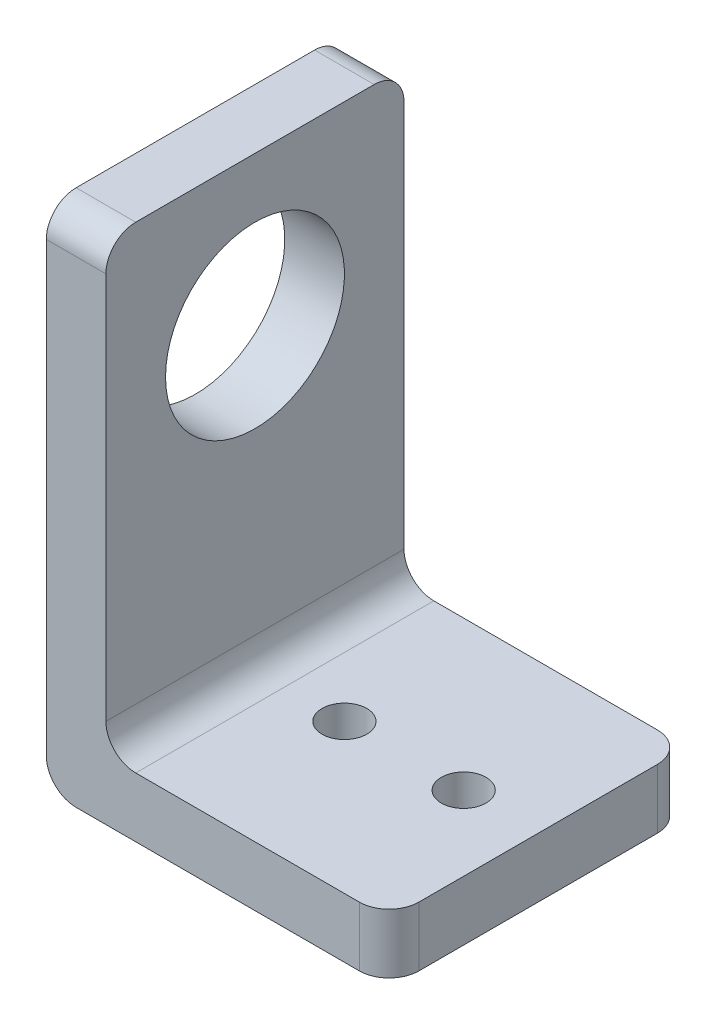
ISO-10303-21;
HEADER;
FILE_DESCRIPTION(('STEP AP214'),'2;1');
FILE_NAME('part.step','',(''),(''),'','','');
FILE_SCHEMA(('AUTOMOTIVE_DESIGN { 1 0 10303 214 1 1 1 1 }'));
ENDSEC;
DATA;
#1=APPLICATION_CONTEXT('core data for automotive mechanical design processes');
#2=APPLICATION_PROTOCOL_DEFINITION('international standard','automotive_design',2000,#1);
#3=PRODUCT_CONTEXT('',#1,'mechanical');
#4=PRODUCT('Part','Part','',(#3));
#5=PRODUCT_RELATED_PRODUCT_CATEGORY('part','',(#4));
#6=PRODUCT_DEFINITION_FORMATION('','',#4);
#7=PRODUCT_DEFINITION_CONTEXT('part definition',#1,'design');
#8=PRODUCT_DEFINITION('design','',#6,#7);
#9=PRODUCT_DEFINITION_SHAPE('','',#8);
#10=(LENGTH_UNIT() NAMED_UNIT(*) SI_UNIT(.MILLI.,.METRE.));
#11=(NAMED_UNIT(*) PLANE_ANGLE_UNIT() SI_UNIT($,.RADIAN.));
#12=(NAMED_UNIT(*) SI_UNIT($,.STERADIAN.) SOLID_ANGLE_UNIT());
#13=UNCERTAINTY_MEASURE_WITH_UNIT(LENGTH_MEASURE(1.E-05),#10,'distance_accuracy_value','');
#14=(GEOMETRIC_REPRESENTATION_CONTEXT(3) GLOBAL_UNCERTAINTY_ASSIGNED_CONTEXT((#13)) GLOBAL_UNIT_ASSIGNED_CONTEXT((#10,
#11,#12)) REPRESENTATION_CONTEXT('',''));
#15=CARTESIAN_POINT('',(0.,0.,0.));
#16=DIRECTION('',(0.,0.,1.));
#17=DIRECTION('',(1.,0.,0.));
#18=AXIS2_PLACEMENT_3D('',#15,#16,#17);
#19=CARTESIAN_POINT('',(0.,34.,20.));
#20=DIRECTION('',(1.,0.,0.));
#21=DIRECTION('',(0.,1.,0.));
#22=AXIS2_PLACEMENT_3D('',#19,#20,#21);
#23=PLANE('',#22);
#24=CARTESIAN_POINT('',(0.,24.,10.));
#25=DIRECTION('',(-1.,0.,0.));
#26=DIRECTION('',(0.,0.,1.));
#27=AXIS2_PLACEMENT_3D('',#24,#25,#26);
#28=CIRCLE('',#27,6.);
#29=CARTESIAN_POINT('',(0.,24.,16.));
#30=VERTEX_POINT('',#29);
#31=EDGE_CURVE('E249',#30,#30,#28,.T.);
#32=ORIENTED_EDGE('',*,*,#31,.F.);
#33=EDGE_LOOP('',(#32));
#34=FACE_BOUND('',#33,.T.);
#35=DIRECTION('',(0.,-1.,0.));
#36=VECTOR('',#35,1.);
#37=CARTESIAN_POINT('',(0.,34.,0.));
#38=LINE('',#37,#36);
#39=CARTESIAN_POINT('',(0.,32.,0.));
#40=VERTEX_POINT('',#39);
#41=CARTESIAN_POINT('',(0.,2.,0.));
#42=VERTEX_POINT('',#41);
#43=EDGE_CURVE('E222',#40,#42,#38,.T.);
#44=ORIENTED_EDGE('',*,*,#43,.T.);
#45=DIRECTION('',(0.,0.,-1.));
#46=VECTOR('',#45,1.);
#47=CARTESIAN_POINT('',(0.,2.,20.));
#48=LINE('',#47,#46);
#49=CARTESIAN_POINT('',(0.,2.,20.));
#50=VERTEX_POINT('',#49);
#51=EDGE_CURVE('E183',#42,#50,#48,.F.);
#52=ORIENTED_EDGE('',*,*,#51,.T.);
#53=DIRECTION('',(0.,-1.,0.));
#54=VECTOR('',#53,1.);
#55=CARTESIAN_POINT('',(0.,34.,20.));
#56=LINE('',#55,#54);
#57=CARTESIAN_POINT('',(0.,32.,20.));
#58=VERTEX_POINT('',#57);
#59=EDGE_CURVE('E228',#58,#50,#56,.T.);
#60=ORIENTED_EDGE('',*,*,#59,.F.);
#61=CARTESIAN_POINT('',(0.,32.,18.));
#62=DIRECTION('',(1.,0.,0.));
#63=DIRECTION('',(0.,1.,0.));
#64=AXIS2_PLACEMENT_3D('',#61,#62,#63);
#65=CIRCLE('',#64,2.);
#66=CARTESIAN_POINT('',(0.,34.,18.));
#67=VERTEX_POINT('',#66);
#68=EDGE_CURVE('E55',#58,#67,#65,.F.);
#69=ORIENTED_EDGE('',*,*,#68,.T.);
#70=DIRECTION('',(0.,0.,-1.));
#71=VECTOR('',#70,1.);
#72=CARTESIAN_POINT('',(0.,34.,20.));
#73=LINE('',#72,#71);
#74=CARTESIAN_POINT('',(0.,34.,2.));
#75=VERTEX_POINT('',#74);
#76=EDGE_CURVE('E215',#67,#75,#73,.T.);
#77=ORIENTED_EDGE('',*,*,#76,.T.);
#78=CARTESIAN_POINT('',(0.,32.,2.));
#79=DIRECTION('',(1.,0.,0.));
#80=DIRECTION('',(0.,1.,0.));
#81=AXIS2_PLACEMENT_3D('',#78,#79,#80);
#82=CIRCLE('',#81,2.);
#83=EDGE_CURVE('E47',#75,#40,#82,.F.);
#84=ORIENTED_EDGE('',*,*,#83,.T.);
#85=EDGE_LOOP('',(#44,#52,#60,#69,#77,#84));
#86=FACE_BOUND('',#85,.T.);
#87=ADVANCED_FACE('F32',(#34,#86),#23,.F.);
#88=CARTESIAN_POINT('',(0.,0.,20.));
#89=DIRECTION('',(0.,1.,0.));
#90=DIRECTION('',(0.,0.,1.));
#91=AXIS2_PLACEMENT_3D('',#88,#89,#90);
#92=PLANE('',#91);
#93=CARTESIAN_POINT('',(10.,0.,10.));
#94=DIRECTION('',(0.,1.,0.));
#95=DIRECTION('',(-1.,0.,0.));
#96=AXIS2_PLACEMENT_3D('',#93,#94,#95);
#97=CIRCLE('',#96,1.5);
#98=CARTESIAN_POINT('',(8.50000000000001,0.,10.));
#99=VERTEX_POINT('',#98);
#100=EDGE_CURVE('E258',#99,#99,#97,.T.);
#101=ORIENTED_EDGE('',*,*,#100,.T.);
#102=EDGE_LOOP('',(#101));
#103=FACE_BOUND('',#102,.T.);
#104=CARTESIAN_POINT('',(18.,0.,10.));
#105=DIRECTION('',(0.,1.,0.));
#106=DIRECTION('',(-1.,0.,0.));
#107=AXIS2_PLACEMENT_3D('',#104,#105,#106);
#108=CIRCLE('',#107,1.5);
#109=CARTESIAN_POINT('',(16.5,0.,10.));
#110=VERTEX_POINT('',#109);
#111=EDGE_CURVE('E252',#110,#110,#108,.T.);
#112=ORIENTED_EDGE('',*,*,#111,.T.);
#113=EDGE_LOOP('',(#112));
#114=FACE_BOUND('',#113,.T.);
#115=DIRECTION('',(1.,0.,0.));
#116=VECTOR('',#115,1.);
#117=CARTESIAN_POINT('',(0.,0.,0.));
#118=LINE('',#117,#116);
#119=CARTESIAN_POINT('',(2.,0.,0.));
#120=VERTEX_POINT('',#119);
#121=CARTESIAN_POINT('',(21.,0.,0.));
#122=VERTEX_POINT('',#121);
#123=EDGE_CURVE('E200',#120,#122,#118,.T.);
#124=ORIENTED_EDGE('',*,*,#123,.T.);
#125=CARTESIAN_POINT('',(21.,0.,2.));
#126=DIRECTION('',(0.,1.,0.));
#127=DIRECTION('',(0.,0.,1.));
#128=AXIS2_PLACEMENT_3D('',#125,#126,#127);
#129=CIRCLE('',#128,2.);
#130=CARTESIAN_POINT('',(23.,0.,2.));
#131=VERTEX_POINT('',#130);
#132=EDGE_CURVE('E165',#122,#131,#129,.F.);
#133=ORIENTED_EDGE('',*,*,#132,.T.);
#134=DIRECTION('',(0.,0.,-1.));
#135=VECTOR('',#134,1.);
#136=CARTESIAN_POINT('',(23.,0.,20.));
#137=LINE('',#136,#135);
#138=CARTESIAN_POINT('',(23.,0.,18.));
#139=VERTEX_POINT('',#138);
#140=EDGE_CURVE('E143',#139,#131,#137,.T.);
#141=ORIENTED_EDGE('',*,*,#140,.F.);
#142=CARTESIAN_POINT('',(21.,0.,18.));
#143=DIRECTION('',(0.,1.,0.));
#144=DIRECTION('',(0.,0.,1.));
#145=AXIS2_PLACEMENT_3D('',#142,#143,#144);
#146=CIRCLE('',#145,2.);
#147=CARTESIAN_POINT('',(21.,0.,20.));
#148=VERTEX_POINT('',#147);
#149=EDGE_CURVE('E148',#139,#148,#146,.F.);
#150=ORIENTED_EDGE('',*,*,#149,.T.);
#151=DIRECTION('',(1.,0.,0.));
#152=VECTOR('',#151,1.);
#153=CARTESIAN_POINT('',(0.,0.,20.));
#154=LINE('',#153,#152);
#155=CARTESIAN_POINT('',(2.,0.,20.));
#156=VERTEX_POINT('',#155);
#157=EDGE_CURVE('E218',#156,#148,#154,.T.);
#158=ORIENTED_EDGE('',*,*,#157,.F.);
#159=DIRECTION('',(0.,0.,-1.));
#160=VECTOR('',#159,1.);
#161=CARTESIAN_POINT('',(2.,0.,20.));
#162=LINE('',#161,#160);
#163=EDGE_CURVE('E161',#156,#120,#162,.T.);
#164=ORIENTED_EDGE('',*,*,#163,.T.);
#165=EDGE_LOOP('',(#124,#133,#141,#150,#158,#164));
#166=FACE_BOUND('',#165,.T.);
#167=ADVANCED_FACE('F246',(#103,#114,#166),#92,.F.);
#168=CARTESIAN_POINT('',(23.,0.,20.));
#169=DIRECTION('',(-1.,0.,0.));
#170=DIRECTION('',(0.,0.,1.));
#171=AXIS2_PLACEMENT_3D('',#168,#169,#170);
#172=PLANE('',#171);
#173=ORIENTED_EDGE('',*,*,#140,.T.);
#174=DIRECTION('',(0.,1.,0.));
#175=VECTOR('',#174,1.);
#176=CARTESIAN_POINT('',(23.,0.,2.));
#177=LINE('',#176,#175);
#178=CARTESIAN_POINT('',(23.,4.00000000000001,2.));
#179=VERTEX_POINT('',#178);
#180=EDGE_CURVE('E142',#131,#179,#177,.T.);
#181=ORIENTED_EDGE('',*,*,#180,.T.);
#182=DIRECTION('',(0.,0.,-1.));
#183=VECTOR('',#182,1.);
#184=CARTESIAN_POINT('',(23.,4.00000000000001,20.));
#185=LINE('',#184,#183);
#186=CARTESIAN_POINT('',(23.,4.00000000000001,18.));
#187=VERTEX_POINT('',#186);
#188=EDGE_CURVE('E125',#187,#179,#185,.T.);
#189=ORIENTED_EDGE('',*,*,#188,.F.);
#190=DIRECTION('',(0.,1.,0.));
#191=VECTOR('',#190,1.);
#192=CARTESIAN_POINT('',(23.,0.,18.));
#193=LINE('',#192,#191);
#194=EDGE_CURVE('E139',#187,#139,#193,.F.);
#195=ORIENTED_EDGE('',*,*,#194,.T.);
#196=EDGE_LOOP('',(#173,#181,#189,#195));
#197=FACE_BOUND('',#196,.T.);
#198=ADVANCED_FACE('F138',(#197),#172,.F.);
#199=CARTESIAN_POINT('',(23.,4.00000000000001,20.));
#200=DIRECTION('',(0.,-1.,0.));
#201=DIRECTION('',(1.,0.,0.));
#202=AXIS2_PLACEMENT_3D('',#199,#200,#201);
#203=PLANE('',#202);
#204=CARTESIAN_POINT('',(10.,4.,10.));
#205=DIRECTION('',(0.,1.,0.));
#206=DIRECTION('',(-1.,0.,0.));
#207=AXIS2_PLACEMENT_3D('',#204,#205,#206);
#208=CIRCLE('',#207,1.5);
#209=CARTESIAN_POINT('',(8.50000000000001,4.,10.));
#210=VERTEX_POINT('',#209);
#211=EDGE_CURVE('E261',#210,#210,#208,.T.);
#212=ORIENTED_EDGE('',*,*,#211,.F.);
#213=EDGE_LOOP('',(#212));
#214=FACE_BOUND('',#213,.T.);
#215=CARTESIAN_POINT('',(18.,4.,10.));
#216=DIRECTION('',(0.,1.,0.));
#217=DIRECTION('',(-1.,0.,0.));
#218=AXIS2_PLACEMENT_3D('',#215,#216,#217);
#219=CIRCLE('',#218,1.5);
#220=CARTESIAN_POINT('',(16.5,4.,10.));
#221=VERTEX_POINT('',#220);
#222=EDGE_CURVE('E255',#221,#221,#219,.T.);
#223=ORIENTED_EDGE('',*,*,#222,.F.);
#224=EDGE_LOOP('',(#223));
#225=FACE_BOUND('',#224,.T.);
#226=ORIENTED_EDGE('',*,*,#188,.T.);
#227=CARTESIAN_POINT('',(21.,4.00000000000001,2.));
#228=DIRECTION('',(0.,-1.,0.));
#229=DIRECTION('',(1.,0.,0.));
#230=AXIS2_PLACEMENT_3D('',#227,#228,#229);
#231=CIRCLE('',#230,2.);
#232=CARTESIAN_POINT('',(21.,4.00000000000001,0.));
#233=VERTEX_POINT('',#232);
#234=EDGE_CURVE('E132',#179,#233,#231,.F.);
#235=ORIENTED_EDGE('',*,*,#234,.T.);
#236=DIRECTION('',(-1.,0.,0.));
#237=VECTOR('',#236,1.);
#238=CARTESIAN_POINT('',(23.,4.00000000000001,0.));
#239=LINE('',#238,#237);
#240=CARTESIAN_POINT('',(6.00000000000001,4.,0.));
#241=VERTEX_POINT('',#240);
#242=EDGE_CURVE('E193',#233,#241,#239,.T.);
#243=ORIENTED_EDGE('',*,*,#242,.T.);
#244=DIRECTION('',(0.,0.,-1.));
#245=VECTOR('',#244,1.);
#246=CARTESIAN_POINT('',(6.00000000000001,4.,20.));
#247=LINE('',#246,#245);
#248=CARTESIAN_POINT('',(6.00000000000001,4.,20.));
#249=VERTEX_POINT('',#248);
#250=EDGE_CURVE('E133',#241,#249,#247,.F.);
#251=ORIENTED_EDGE('',*,*,#250,.T.);
#252=DIRECTION('',(-1.,0.,0.));
#253=VECTOR('',#252,1.);
#254=CARTESIAN_POINT('',(23.,4.00000000000001,20.));
#255=LINE('',#254,#253);
#256=CARTESIAN_POINT('',(21.,4.00000000000001,20.));
#257=VERTEX_POINT('',#256);
#258=EDGE_CURVE('E127',#257,#249,#255,.T.);
#259=ORIENTED_EDGE('',*,*,#258,.F.);
#260=CARTESIAN_POINT('',(21.,4.00000000000001,18.));
#261=DIRECTION('',(0.,-1.,0.));
#262=DIRECTION('',(1.,0.,0.));
#263=AXIS2_PLACEMENT_3D('',#260,#261,#262);
#264=CIRCLE('',#263,2.);
#265=EDGE_CURVE('E122',#257,#187,#264,.F.);
#266=ORIENTED_EDGE('',*,*,#265,.T.);
#267=EDGE_LOOP('',(#226,#235,#243,#251,#259,#266));
#268=FACE_BOUND('',#267,.T.);
#269=ADVANCED_FACE('F124',(#214,#225,#268),#203,.F.);
#270=CARTESIAN_POINT('',(4.00000000000001,4.,20.));
#271=DIRECTION('',(-1.,0.,0.));
#272=DIRECTION('',(0.,0.,1.));
#273=AXIS2_PLACEMENT_3D('',#270,#271,#272);
#274=PLANE('',#273);
#275=CARTESIAN_POINT('',(4.,24.,10.));
#276=DIRECTION('',(-1.,0.,0.));
#277=DIRECTION('',(0.,0.,1.));
#278=AXIS2_PLACEMENT_3D('',#275,#276,#277);
#279=CIRCLE('',#278,6.);
#280=CARTESIAN_POINT('',(4.,24.,16.));
#281=VERTEX_POINT('',#280);
#282=EDGE_CURVE('E225',#281,#281,#279,.T.);
#283=ORIENTED_EDGE('',*,*,#282,.T.);
#284=EDGE_LOOP('',(#283));
#285=FACE_BOUND('',#284,.T.);
#286=DIRECTION('',(0.,1.,0.));
#287=VECTOR('',#286,1.);
#288=CARTESIAN_POINT('',(4.00000000000001,4.,20.));
#289=LINE('',#288,#287);
#290=CARTESIAN_POINT('',(4.00000000000001,6.,20.));
#291=VERTEX_POINT('',#290);
#292=CARTESIAN_POINT('',(4.00000000000001,32.,20.));
#293=VERTEX_POINT('',#292);
#294=EDGE_CURVE('E209',#291,#293,#289,.T.);
#295=ORIENTED_EDGE('',*,*,#294,.F.);
#296=DIRECTION('',(0.,0.,-1.));
#297=VECTOR('',#296,1.);
#298=CARTESIAN_POINT('',(4.00000000000001,6.,0.));
#299=LINE('',#298,#297);
#300=CARTESIAN_POINT('',(4.00000000000001,6.,0.));
#301=VERTEX_POINT('',#300);
#302=EDGE_CURVE('E178',#291,#301,#299,.T.);
#303=ORIENTED_EDGE('',*,*,#302,.T.);
#304=DIRECTION('',(0.,1.,0.));
#305=VECTOR('',#304,1.);
#306=CARTESIAN_POINT('',(4.00000000000001,4.,0.));
#307=LINE('',#306,#305);
#308=CARTESIAN_POINT('',(4.00000000000001,32.,0.));
#309=VERTEX_POINT('',#308);
#310=EDGE_CURVE('E196',#301,#309,#307,.T.);
#311=ORIENTED_EDGE('',*,*,#310,.T.);
#312=CARTESIAN_POINT('',(4.00000000000001,32.,2.));
#313=DIRECTION('',(-1.,0.,0.));
#314=DIRECTION('',(0.,0.,1.));
#315=AXIS2_PLACEMENT_3D('',#312,#313,#314);
#316=CIRCLE('',#315,2.);
#317=CARTESIAN_POINT('',(4.00000000000001,34.,2.));
#318=VERTEX_POINT('',#317);
#319=EDGE_CURVE('E176',#309,#318,#316,.F.);
#320=ORIENTED_EDGE('',*,*,#319,.T.);
#321=DIRECTION('',(0.,0.,-1.));
#322=VECTOR('',#321,1.);
#323=CARTESIAN_POINT('',(4.00000000000001,34.,20.));
#324=LINE('',#323,#322);
#325=CARTESIAN_POINT('',(4.00000000000001,34.,18.));
#326=VERTEX_POINT('',#325);
#327=EDGE_CURVE('E144',#326,#318,#324,.T.);
#328=ORIENTED_EDGE('',*,*,#327,.F.);
#329=CARTESIAN_POINT('',(4.00000000000001,32.,18.));
#330=DIRECTION('',(-1.,0.,0.));
#331=DIRECTION('',(0.,0.,1.));
#332=AXIS2_PLACEMENT_3D('',#329,#330,#331);
#333=CIRCLE('',#332,2.);
#334=EDGE_CURVE('E174',#326,#293,#333,.F.);
#335=ORIENTED_EDGE('',*,*,#334,.T.);
#336=EDGE_LOOP('',(#295,#303,#311,#320,#328,#335));
#337=FACE_BOUND('',#336,.T.);
#338=ADVANCED_FACE('F212',(#285,#337),#274,.F.);
#339=CARTESIAN_POINT('',(4.00000000000001,34.,20.));
#340=DIRECTION('',(0.,-1.,0.));
#341=DIRECTION('',(0.,0.,-1.));
#342=AXIS2_PLACEMENT_3D('',#339,#340,#341);
#343=PLANE('',#342);
#344=ORIENTED_EDGE('',*,*,#327,.T.);
#345=DIRECTION('',(-1.,0.,0.));
#346=VECTOR('',#345,1.);
#347=CARTESIAN_POINT('',(4.00000000000001,34.,2.));
#348=LINE('',#347,#346);
#349=EDGE_CURVE('E187',#318,#75,#348,.T.);
#350=ORIENTED_EDGE('',*,*,#349,.T.);
#351=ORIENTED_EDGE('',*,*,#76,.F.);
#352=DIRECTION('',(-1.,0.,0.));
#353=VECTOR('',#352,1.);
#354=CARTESIAN_POINT('',(4.00000000000001,34.,18.));
#355=LINE('',#354,#353);
#356=EDGE_CURVE('E185',#67,#326,#355,.F.);
#357=ORIENTED_EDGE('',*,*,#356,.T.);
#358=EDGE_LOOP('',(#344,#350,#351,#357));
#359=FACE_BOUND('',#358,.T.);
#360=ADVANCED_FACE('F232',(#359),#343,.F.);
#361=CARTESIAN_POINT('',(0.,0.,20.));
#362=DIRECTION('',(0.,0.,1.));
#363=DIRECTION('',(1.,0.,0.));
#364=AXIS2_PLACEMENT_3D('',#361,#362,#363);
#365=PLANE('',#364);
#366=ORIENTED_EDGE('',*,*,#157,.T.);
#367=DIRECTION('',(0.,1.,0.));
#368=VECTOR('',#367,1.);
#369=CARTESIAN_POINT('',(21.,4.00000000000001,20.));
#370=LINE('',#369,#368);
#371=EDGE_CURVE('E172',#148,#257,#370,.T.);
#372=ORIENTED_EDGE('',*,*,#371,.T.);
#373=ORIENTED_EDGE('',*,*,#258,.T.);
#374=CARTESIAN_POINT('',(6.00000000000001,6.,20.));
#375=DIRECTION('',(0.,0.,1.));
#376=DIRECTION('',(1.,0.,0.));
#377=AXIS2_PLACEMENT_3D('',#374,#375,#376);
#378=CIRCLE('',#377,2.);
#379=EDGE_CURVE('E11',#249,#291,#378,.F.);
#380=ORIENTED_EDGE('',*,*,#379,.T.);
#381=ORIENTED_EDGE('',*,*,#294,.T.);
#382=DIRECTION('',(-1.,0.,0.));
#383=VECTOR('',#382,1.);
#384=CARTESIAN_POINT('',(0.,32.,20.));
#385=LINE('',#384,#383);
#386=EDGE_CURVE('E167',#293,#58,#385,.T.);
#387=ORIENTED_EDGE('',*,*,#386,.T.);
#388=ORIENTED_EDGE('',*,*,#59,.T.);
#389=CARTESIAN_POINT('',(2.,2.,20.));
#390=DIRECTION('',(0.,0.,1.));
#391=DIRECTION('',(1.,0.,0.));
#392=AXIS2_PLACEMENT_3D('',#389,#390,#391);
#393=CIRCLE('',#392,2.);
#394=EDGE_CURVE('E170',#50,#156,#393,.T.);
#395=ORIENTED_EDGE('',*,*,#394,.T.);
#396=EDGE_LOOP('',(#366,#372,#373,#380,#381,#387,#388,#395));
#397=FACE_BOUND('',#396,.T.);
#398=ADVANCED_FACE('F208',(#397),#365,.T.);
#399=CARTESIAN_POINT('',(0.,0.,0.));
#400=DIRECTION('',(0.,0.,1.));
#401=DIRECTION('',(1.,0.,0.));
#402=AXIS2_PLACEMENT_3D('',#399,#400,#401);
#403=PLANE('',#402);
#404=ORIENTED_EDGE('',*,*,#242,.F.);
#405=DIRECTION('',(0.,1.,0.));
#406=VECTOR('',#405,1.);
#407=CARTESIAN_POINT('',(21.,0.,0.));
#408=LINE('',#407,#406);
#409=EDGE_CURVE('E159',#233,#122,#408,.F.);
#410=ORIENTED_EDGE('',*,*,#409,.T.);
#411=ORIENTED_EDGE('',*,*,#123,.F.);
#412=CARTESIAN_POINT('',(2.,2.,0.));
#413=DIRECTION('',(0.,0.,1.));
#414=DIRECTION('',(1.,0.,0.));
#415=AXIS2_PLACEMENT_3D('',#412,#413,#414);
#416=CIRCLE('',#415,2.);
#417=EDGE_CURVE('E157',#120,#42,#416,.F.);
#418=ORIENTED_EDGE('',*,*,#417,.T.);
#419=ORIENTED_EDGE('',*,*,#43,.F.);
#420=DIRECTION('',(-1.,0.,0.));
#421=VECTOR('',#420,1.);
#422=CARTESIAN_POINT('',(0.,32.,0.));
#423=LINE('',#422,#421);
#424=EDGE_CURVE('E155',#40,#309,#423,.F.);
#425=ORIENTED_EDGE('',*,*,#424,.T.);
#426=ORIENTED_EDGE('',*,*,#310,.F.);
#427=CARTESIAN_POINT('',(6.00000000000001,6.,0.));
#428=DIRECTION('',(0.,0.,1.));
#429=DIRECTION('',(1.,0.,0.));
#430=AXIS2_PLACEMENT_3D('',#427,#428,#429);
#431=CIRCLE('',#430,2.);
#432=EDGE_CURVE('E40',#301,#241,#431,.T.);
#433=ORIENTED_EDGE('',*,*,#432,.T.);
#434=EDGE_LOOP('',(#404,#410,#411,#418,#419,#425,#426,#433));
#435=FACE_BOUND('',#434,.T.);
#436=ADVANCED_FACE('F192',(#435),#403,.F.);
#437=CARTESIAN_POINT('',(4.,24.,10.));
#438=DIRECTION('',(-1.,0.,0.));
#439=DIRECTION('',(0.,0.,1.));
#440=AXIS2_PLACEMENT_3D('',#437,#438,#439);
#441=CYLINDRICAL_SURFACE('',#440,6.);
#442=ORIENTED_EDGE('',*,*,#282,.F.);
#443=EDGE_LOOP('',(#442));
#444=FACE_BOUND('',#443,.T.);
#445=ORIENTED_EDGE('',*,*,#31,.T.);
#446=EDGE_LOOP('',(#445));
#447=FACE_BOUND('',#446,.T.);
#448=ADVANCED_FACE('F283',(#444,#447),#441,.F.);
#449=CARTESIAN_POINT('',(18.,0.,10.));
#450=DIRECTION('',(0.,1.,0.));
#451=DIRECTION('',(-1.,0.,0.));
#452=AXIS2_PLACEMENT_3D('',#449,#450,#451);
#453=CYLINDRICAL_SURFACE('',#452,1.5);
#454=ORIENTED_EDGE('',*,*,#111,.F.);
#455=EDGE_LOOP('',(#454));
#456=FACE_BOUND('',#455,.T.);
#457=ORIENTED_EDGE('',*,*,#222,.T.);
#458=EDGE_LOOP('',(#457));
#459=FACE_BOUND('',#458,.T.);
#460=ADVANCED_FACE('F273',(#456,#459),#453,.F.);
#461=CARTESIAN_POINT('',(10.,0.,10.));
#462=DIRECTION('',(0.,1.,0.));
#463=DIRECTION('',(-1.,0.,0.));
#464=AXIS2_PLACEMENT_3D('',#461,#462,#463);
#465=CYLINDRICAL_SURFACE('',#464,1.5);
#466=ORIENTED_EDGE('',*,*,#100,.F.);
#467=EDGE_LOOP('',(#466));
#468=FACE_BOUND('',#467,.T.);
#469=ORIENTED_EDGE('',*,*,#211,.T.);
#470=EDGE_LOOP('',(#469));
#471=FACE_BOUND('',#470,.T.);
#472=ADVANCED_FACE('F269',(#468,#471),#465,.F.);
#473=CARTESIAN_POINT('',(21.,0.,2.));
#474=DIRECTION('',(0.,1.,0.));
#475=DIRECTION('',(0.,0.,1.));
#476=AXIS2_PLACEMENT_3D('',#473,#474,#475);
#477=CYLINDRICAL_SURFACE('',#476,2.);
#478=ORIENTED_EDGE('',*,*,#132,.F.);
#479=ORIENTED_EDGE('',*,*,#409,.F.);
#480=ORIENTED_EDGE('',*,*,#234,.F.);
#481=ORIENTED_EDGE('',*,*,#180,.F.);
#482=EDGE_LOOP('',(#478,#479,#480,#481));
#483=FACE_BOUND('',#482,.T.);
#484=ADVANCED_FACE('F272',(#483),#477,.T.);
#485=CARTESIAN_POINT('',(21.,0.,18.));
#486=DIRECTION('',(0.,-1.,0.));
#487=DIRECTION('',(0.,0.,-1.));
#488=AXIS2_PLACEMENT_3D('',#485,#486,#487);
#489=CYLINDRICAL_SURFACE('',#488,2.);
#490=ORIENTED_EDGE('',*,*,#149,.F.);
#491=ORIENTED_EDGE('',*,*,#194,.F.);
#492=ORIENTED_EDGE('',*,*,#265,.F.);
#493=ORIENTED_EDGE('',*,*,#371,.F.);
#494=EDGE_LOOP('',(#490,#491,#492,#493));
#495=FACE_BOUND('',#494,.T.);
#496=ADVANCED_FACE('F147',(#495),#489,.T.);
#497=CARTESIAN_POINT('',(6.00000000000001,6.,20.));
#498=DIRECTION('',(0.,0.,1.));
#499=DIRECTION('',(1.,0.,0.));
#500=AXIS2_PLACEMENT_3D('',#497,#498,#499);
#501=CYLINDRICAL_SURFACE('',#500,2.);
#502=ORIENTED_EDGE('',*,*,#379,.F.);
#503=ORIENTED_EDGE('',*,*,#250,.F.);
#504=ORIENTED_EDGE('',*,*,#432,.F.);
#505=ORIENTED_EDGE('',*,*,#302,.F.);
#506=EDGE_LOOP('',(#502,#503,#504,#505));
#507=FACE_BOUND('',#506,.T.);
#508=ADVANCED_FACE('F203',(#507),#501,.F.);
#509=CARTESIAN_POINT('',(2.,2.,20.));
#510=DIRECTION('',(0.,0.,-1.));
#511=DIRECTION('',(-1.,0.,0.));
#512=AXIS2_PLACEMENT_3D('',#509,#510,#511);
#513=CYLINDRICAL_SURFACE('',#512,2.);
#514=ORIENTED_EDGE('',*,*,#394,.F.);
#515=ORIENTED_EDGE('',*,*,#51,.F.);
#516=ORIENTED_EDGE('',*,*,#417,.F.);
#517=ORIENTED_EDGE('',*,*,#163,.F.);
#518=EDGE_LOOP('',(#514,#515,#516,#517));
#519=FACE_BOUND('',#518,.T.);
#520=ADVANCED_FACE('F242',(#519),#513,.T.);
#521=CARTESIAN_POINT('',(4.00000000000001,32.,2.));
#522=DIRECTION('',(-1.,0.,0.));
#523=DIRECTION('',(0.,0.,1.));
#524=AXIS2_PLACEMENT_3D('',#521,#522,#523);
#525=CYLINDRICAL_SURFACE('',#524,2.);
#526=ORIENTED_EDGE('',*,*,#319,.F.);
#527=ORIENTED_EDGE('',*,*,#424,.F.);
#528=ORIENTED_EDGE('',*,*,#83,.F.);
#529=ORIENTED_EDGE('',*,*,#349,.F.);
#530=EDGE_LOOP('',(#526,#527,#528,#529));
#531=FACE_BOUND('',#530,.T.);
#532=ADVANCED_FACE('F235',(#531),#525,.T.);
#533=CARTESIAN_POINT('',(0.,32.,18.));
#534=DIRECTION('',(1.,0.,0.));
#535=DIRECTION('',(0.,0.,-1.));
#536=AXIS2_PLACEMENT_3D('',#533,#534,#535);
#537=CYLINDRICAL_SURFACE('',#536,2.);
#538=ORIENTED_EDGE('',*,*,#334,.F.);
#539=ORIENTED_EDGE('',*,*,#356,.F.);
#540=ORIENTED_EDGE('',*,*,#68,.F.);
#541=ORIENTED_EDGE('',*,*,#386,.F.);
#542=EDGE_LOOP('',(#538,#539,#540,#541));
#543=FACE_BOUND('',#542,.T.);
#544=ADVANCED_FACE('F34',(#543),#537,.T.);
#545=CLOSED_SHELL('',(#87,#167,#198,#269,#338,#360,#398,#436,#448,#460,#472,#484,#496,#508,#520,
#532,#544));
#546=MANIFOLD_SOLID_BREP('B2',#545);
#547=ADVANCED_BREP_SHAPE_REPRESENTATION('',(#18,#546),#14);
#548=SHAPE_DEFINITION_REPRESENTATION(#9,#547);
ENDSEC;
END-ISO-10303-21;
